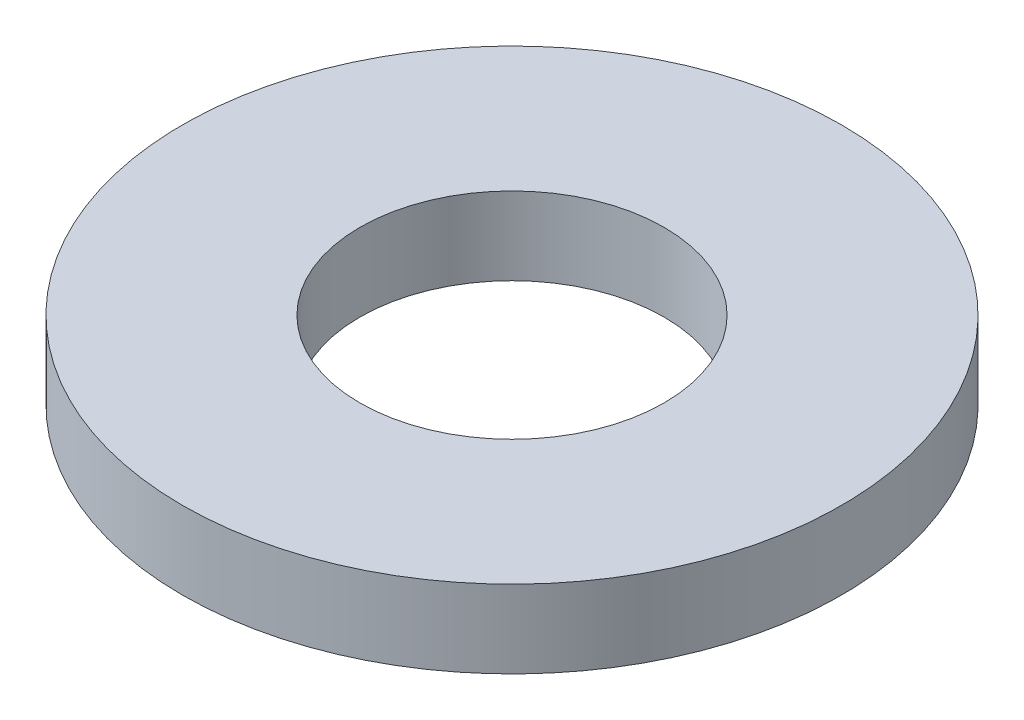
ISO-10303-21;
HEADER;
FILE_DESCRIPTION(('STEP AP214'),'2;1');
FILE_NAME('part.step','',(''),(''),'','','');
FILE_SCHEMA(('AUTOMOTIVE_DESIGN { 1 0 10303 214 1 1 1 1 }'));
ENDSEC;
DATA;
#1=APPLICATION_CONTEXT('core data for automotive mechanical design processes');
#2=APPLICATION_PROTOCOL_DEFINITION('international standard','automotive_design',2000,#1);
#3=PRODUCT_CONTEXT('',#1,'mechanical');
#4=PRODUCT('Part','Part','',(#3));
#5=PRODUCT_RELATED_PRODUCT_CATEGORY('part','',(#4));
#6=PRODUCT_DEFINITION_FORMATION('','',#4);
#7=PRODUCT_DEFINITION_CONTEXT('part definition',#1,'design');
#8=PRODUCT_DEFINITION('design','',#6,#7);
#9=PRODUCT_DEFINITION_SHAPE('','',#8);
#10=(LENGTH_UNIT() NAMED_UNIT(*) SI_UNIT(.MILLI.,.METRE.));
#11=(NAMED_UNIT(*) PLANE_ANGLE_UNIT() SI_UNIT($,.RADIAN.));
#12=(NAMED_UNIT(*) SI_UNIT($,.STERADIAN.) SOLID_ANGLE_UNIT());
#13=UNCERTAINTY_MEASURE_WITH_UNIT(LENGTH_MEASURE(1.E-05),#10,'distance_accuracy_value','');
#14=(GEOMETRIC_REPRESENTATION_CONTEXT(3) GLOBAL_UNCERTAINTY_ASSIGNED_CONTEXT((#13)) GLOBAL_UNIT_ASSIGNED_CONTEXT((#10,
#11,#12)) REPRESENTATION_CONTEXT('',''));
#15=CARTESIAN_POINT('',(0.,0.,0.));
#16=DIRECTION('',(0.,0.,1.));
#17=DIRECTION('',(1.,0.,0.));
#18=AXIS2_PLACEMENT_3D('',#15,#16,#17);
#19=CARTESIAN_POINT('',(0.,23.,0.));
#20=DIRECTION('',(0.,-1.,0.));
#21=DIRECTION('',(0.,0.,-1.));
#22=AXIS2_PLACEMENT_3D('',#19,#20,#21);
#23=CYLINDRICAL_SURFACE('',#22,97.5);
#24=CARTESIAN_POINT('',(0.,23.,0.));
#25=DIRECTION('',(0.,1.,0.));
#26=DIRECTION('',(0.,0.,1.));
#27=AXIS2_PLACEMENT_3D('',#24,#25,#26);
#28=CIRCLE('',#27,97.5);
#29=CARTESIAN_POINT('',(0.,23.,97.5));
#30=VERTEX_POINT('',#29);
#31=EDGE_CURVE('E10',#30,#30,#28,.T.);
#32=ORIENTED_EDGE('',*,*,#31,.F.);
#33=EDGE_LOOP('',(#32));
#34=FACE_BOUND('',#33,.T.);
#35=CARTESIAN_POINT('',(0.,0.,0.));
#36=DIRECTION('',(0.,1.,0.));
#37=DIRECTION('',(0.,0.,1.));
#38=AXIS2_PLACEMENT_3D('',#35,#36,#37);
#39=CIRCLE('',#38,97.5);
#40=CARTESIAN_POINT('',(0.,0.,97.5));
#41=VERTEX_POINT('',#40);
#42=EDGE_CURVE('E37',#41,#41,#39,.T.);
#43=ORIENTED_EDGE('',*,*,#42,.T.);
#44=EDGE_LOOP('',(#43));
#45=FACE_BOUND('',#44,.T.);
#46=ADVANCED_FACE('F40',(#34,#45),#23,.T.);
#47=CARTESIAN_POINT('',(0.,23.,0.));
#48=DIRECTION('',(0.,1.,0.));
#49=DIRECTION('',(0.,0.,1.));
#50=AXIS2_PLACEMENT_3D('',#47,#48,#49);
#51=PLANE('',#50);
#52=CARTESIAN_POINT('',(0.,23.,0.));
#53=DIRECTION('',(0.,1.,0.));
#54=DIRECTION('',(0.,0.,1.));
#55=AXIS2_PLACEMENT_3D('',#52,#53,#54);
#56=CIRCLE('',#55,45.);
#57=CARTESIAN_POINT('',(0.,23.,45.));
#58=VERTEX_POINT('',#57);
#59=EDGE_CURVE('E50',#58,#58,#56,.T.);
#60=ORIENTED_EDGE('',*,*,#59,.F.);
#61=EDGE_LOOP('',(#60));
#62=FACE_BOUND('',#61,.T.);
#63=ORIENTED_EDGE('',*,*,#31,.T.);
#64=EDGE_LOOP('',(#63));
#65=FACE_BOUND('',#64,.T.);
#66=ADVANCED_FACE('F59',(#62,#65),#51,.T.);
#67=CARTESIAN_POINT('',(0.,0.,0.));
#68=DIRECTION('',(0.,1.,0.));
#69=DIRECTION('',(0.,0.,1.));
#70=AXIS2_PLACEMENT_3D('',#67,#68,#69);
#71=PLANE('',#70);
#72=CARTESIAN_POINT('',(0.,0.,0.));
#73=DIRECTION('',(0.,1.,0.));
#74=DIRECTION('',(0.,0.,1.));
#75=AXIS2_PLACEMENT_3D('',#72,#73,#74);
#76=CIRCLE('',#75,45.);
#77=CARTESIAN_POINT('',(0.,0.,45.));
#78=VERTEX_POINT('',#77);
#79=EDGE_CURVE('E47',#78,#78,#76,.T.);
#80=ORIENTED_EDGE('',*,*,#79,.T.);
#81=EDGE_LOOP('',(#80));
#82=FACE_BOUND('',#81,.T.);
#83=ORIENTED_EDGE('',*,*,#42,.F.);
#84=EDGE_LOOP('',(#83));
#85=FACE_BOUND('',#84,.T.);
#86=ADVANCED_FACE('F58',(#82,#85),#71,.F.);
#87=CARTESIAN_POINT('',(0.,23.,0.));
#88=DIRECTION('',(0.,-1.,0.));
#89=DIRECTION('',(0.,0.,-1.));
#90=AXIS2_PLACEMENT_3D('',#87,#88,#89);
#91=CYLINDRICAL_SURFACE('',#90,45.);
#92=ORIENTED_EDGE('',*,*,#59,.T.);
#93=EDGE_LOOP('',(#92));
#94=FACE_BOUND('',#93,.T.);
#95=ORIENTED_EDGE('',*,*,#79,.F.);
#96=EDGE_LOOP('',(#95));
#97=FACE_BOUND('',#96,.T.);
#98=ADVANCED_FACE('F54',(#94,#97),#91,.F.);
#99=CLOSED_SHELL('',(#46,#66,#86,#98));
#100=MANIFOLD_SOLID_BREP('B2',#99);
#101=ADVANCED_BREP_SHAPE_REPRESENTATION('',(#18,#100),#14);
#102=SHAPE_DEFINITION_REPRESENTATION(#9,#101);
ENDSEC;
END-ISO-10303-21;
